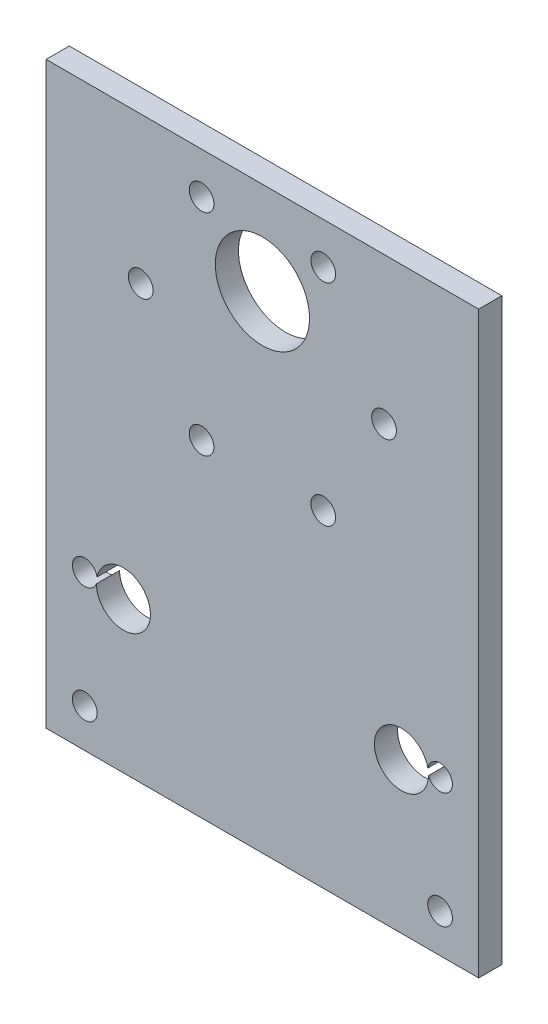
ISO-10303-21;
HEADER;
FILE_DESCRIPTION(('STEP AP214'),'2;1');
FILE_NAME('part.step','',(''),(''),'','','');
FILE_SCHEMA(('AUTOMOTIVE_DESIGN { 1 0 10303 214 1 1 1 1 }'));
ENDSEC;
DATA;
#1=APPLICATION_CONTEXT('core data for automotive mechanical design processes');
#2=APPLICATION_PROTOCOL_DEFINITION('international standard','automotive_design',2000,#1);
#3=PRODUCT_CONTEXT('',#1,'mechanical');
#4=PRODUCT('Part','Part','',(#3));
#5=PRODUCT_RELATED_PRODUCT_CATEGORY('part','',(#4));
#6=PRODUCT_DEFINITION_FORMATION('','',#4);
#7=PRODUCT_DEFINITION_CONTEXT('part definition',#1,'design');
#8=PRODUCT_DEFINITION('design','',#6,#7);
#9=PRODUCT_DEFINITION_SHAPE('','',#8);
#10=(LENGTH_UNIT() NAMED_UNIT(*) SI_UNIT(.MILLI.,.METRE.));
#11=(NAMED_UNIT(*) PLANE_ANGLE_UNIT() SI_UNIT($,.RADIAN.));
#12=(NAMED_UNIT(*) SI_UNIT($,.STERADIAN.) SOLID_ANGLE_UNIT());
#13=UNCERTAINTY_MEASURE_WITH_UNIT(LENGTH_MEASURE(1.E-05),#10,'distance_accuracy_value','');
#14=(GEOMETRIC_REPRESENTATION_CONTEXT(3) GLOBAL_UNCERTAINTY_ASSIGNED_CONTEXT((#13)) GLOBAL_UNIT_ASSIGNED_CONTEXT((#10,
#11,#12)) REPRESENTATION_CONTEXT('',''));
#15=CARTESIAN_POINT('',(0.,0.,0.));
#16=DIRECTION('',(0.,0.,1.));
#17=DIRECTION('',(1.,0.,0.));
#18=AXIS2_PLACEMENT_3D('',#15,#16,#17);
#19=CARTESIAN_POINT('',(28.,0.,3.));
#20=DIRECTION('',(1.,0.,0.));
#21=DIRECTION('',(0.,0.,-1.));
#22=AXIS2_PLACEMENT_3D('',#19,#20,#21);
#23=PLANE('',#22);
#24=DIRECTION('',(0.,-1.,0.));
#25=VECTOR('',#24,1.);
#26=CARTESIAN_POINT('',(28.,0.,0.));
#27=LINE('',#26,#25);
#28=CARTESIAN_POINT('',(28.,62.5,0.));
#29=VERTEX_POINT('',#28);
#30=CARTESIAN_POINT('',(28.,-12.5,0.));
#31=VERTEX_POINT('',#30);
#32=EDGE_CURVE('E186',#29,#31,#27,.T.);
#33=ORIENTED_EDGE('',*,*,#32,.F.);
#34=DIRECTION('',(0.,0.,-1.));
#35=VECTOR('',#34,1.);
#36=CARTESIAN_POINT('',(28.,62.5,3.));
#37=LINE('',#36,#35);
#38=CARTESIAN_POINT('',(28.,62.5,3.));
#39=VERTEX_POINT('',#38);
#40=EDGE_CURVE('E130',#39,#29,#37,.T.);
#41=ORIENTED_EDGE('',*,*,#40,.F.);
#42=DIRECTION('',(0.,-1.,0.));
#43=VECTOR('',#42,1.);
#44=CARTESIAN_POINT('',(28.,0.,3.));
#45=LINE('',#44,#43);
#46=CARTESIAN_POINT('',(28.,-12.5,3.));
#47=VERTEX_POINT('',#46);
#48=EDGE_CURVE('E121',#39,#47,#45,.T.);
#49=ORIENTED_EDGE('',*,*,#48,.T.);
#50=DIRECTION('',(0.,0.,-1.));
#51=VECTOR('',#50,1.);
#52=CARTESIAN_POINT('',(28.,-12.5,3.));
#53=LINE('',#52,#51);
#54=EDGE_CURVE('E55',#47,#31,#53,.T.);
#55=ORIENTED_EDGE('',*,*,#54,.T.);
#56=EDGE_LOOP('',(#33,#41,#49,#55));
#57=FACE_BOUND('',#56,.T.);
#58=ADVANCED_FACE('F47',(#57),#23,.T.);
#59=CARTESIAN_POINT('',(-28.,0.,3.));
#60=DIRECTION('',(1.,0.,0.));
#61=DIRECTION('',(0.,0.,-1.));
#62=AXIS2_PLACEMENT_3D('',#59,#60,#61);
#63=PLANE('',#62);
#64=DIRECTION('',(0.,-1.,0.));
#65=VECTOR('',#64,1.);
#66=CARTESIAN_POINT('',(-28.,0.,0.));
#67=LINE('',#66,#65);
#68=CARTESIAN_POINT('',(-28.,62.5,0.));
#69=VERTEX_POINT('',#68);
#70=CARTESIAN_POINT('',(-28.,-12.5,0.));
#71=VERTEX_POINT('',#70);
#72=EDGE_CURVE('E189',#69,#71,#67,.T.);
#73=ORIENTED_EDGE('',*,*,#72,.T.);
#74=DIRECTION('',(0.,0.,-1.));
#75=VECTOR('',#74,1.);
#76=CARTESIAN_POINT('',(-28.,-12.5,3.));
#77=LINE('',#76,#75);
#78=CARTESIAN_POINT('',(-28.,-12.5,3.));
#79=VERTEX_POINT('',#78);
#80=EDGE_CURVE('E12',#79,#71,#77,.T.);
#81=ORIENTED_EDGE('',*,*,#80,.F.);
#82=DIRECTION('',(0.,-1.,0.));
#83=VECTOR('',#82,1.);
#84=CARTESIAN_POINT('',(-28.,0.,3.));
#85=LINE('',#84,#83);
#86=CARTESIAN_POINT('',(-28.,62.5,3.));
#87=VERTEX_POINT('',#86);
#88=EDGE_CURVE('E113',#87,#79,#85,.T.);
#89=ORIENTED_EDGE('',*,*,#88,.F.);
#90=DIRECTION('',(0.,0.,1.));
#91=VECTOR('',#90,1.);
#92=CARTESIAN_POINT('',(-28.,62.5,3.));
#93=LINE('',#92,#91);
#94=EDGE_CURVE('E118',#69,#87,#93,.T.);
#95=ORIENTED_EDGE('',*,*,#94,.F.);
#96=EDGE_LOOP('',(#73,#81,#89,#95));
#97=FACE_BOUND('',#96,.T.);
#98=ADVANCED_FACE('F116',(#97),#63,.F.);
#99=CARTESIAN_POINT('',(-18.,7.,3.));
#100=DIRECTION('',(0.,0.,-1.));
#101=DIRECTION('',(-1.,0.,0.));
#102=AXIS2_PLACEMENT_3D('',#99,#100,#101);
#103=CYLINDRICAL_SURFACE('',#102,3.50000000000001);
#104=DIRECTION('',(0.,0.,1.));
#105=VECTOR('',#104,1.);
#106=CARTESIAN_POINT('',(-21.4192533056283,7.74746694371741,0.));
#107=LINE('',#106,#105);
#108=CARTESIAN_POINT('',(-21.4192533056283,7.74746694371741,0.));
#109=VERTEX_POINT('',#108);
#110=CARTESIAN_POINT('',(-21.4192533056283,7.74746694371741,3.));
#111=VERTEX_POINT('',#110);
#112=EDGE_CURVE('E167',#109,#111,#107,.T.);
#113=ORIENTED_EDGE('',*,*,#112,.F.);
#114=CARTESIAN_POINT('',(-18.,7.,0.));
#115=DIRECTION('',(0.,0.,1.));
#116=DIRECTION('',(1.,0.,0.));
#117=AXIS2_PLACEMENT_3D('',#114,#115,#116);
#118=CIRCLE('',#117,3.50000000000001);
#119=CARTESIAN_POINT('',(-21.4995585755599,6.9444142444014,0.));
#120=VERTEX_POINT('',#119);
#121=EDGE_CURVE('E183',#120,#109,#118,.T.);
#122=ORIENTED_EDGE('',*,*,#121,.F.);
#123=DIRECTION('',(0.,0.,1.));
#124=VECTOR('',#123,1.);
#125=CARTESIAN_POINT('',(-21.4995585755599,6.9444142444014,0.));
#126=LINE('',#125,#124);
#127=CARTESIAN_POINT('',(-21.4995585755599,6.9444142444014,3.));
#128=VERTEX_POINT('',#127);
#129=EDGE_CURVE('E62',#120,#128,#126,.T.);
#130=ORIENTED_EDGE('',*,*,#129,.T.);
#131=CARTESIAN_POINT('',(-18.,7.,3.));
#132=DIRECTION('',(0.,0.,1.));
#133=DIRECTION('',(1.,0.,0.));
#134=AXIS2_PLACEMENT_3D('',#131,#132,#133);
#135=CIRCLE('',#134,3.50000000000001);
#136=EDGE_CURVE('E175',#128,#111,#135,.T.);
#137=ORIENTED_EDGE('',*,*,#136,.T.);
#138=EDGE_LOOP('',(#113,#122,#130,#137));
#139=FACE_BOUND('',#138,.T.);
#140=ADVANCED_FACE('F218',(#139),#103,.F.);
#141=CARTESIAN_POINT('',(18.,7.,3.));
#142=DIRECTION('',(0.,0.,-1.));
#143=DIRECTION('',(-1.,0.,0.));
#144=AXIS2_PLACEMENT_3D('',#141,#142,#143);
#145=CYLINDRICAL_SURFACE('',#144,3.50000000000001);
#146=DIRECTION('',(0.,0.,1.));
#147=VECTOR('',#146,1.);
#148=CARTESIAN_POINT('',(21.4995585755599,6.9444142444014,0.));
#149=LINE('',#148,#147);
#150=CARTESIAN_POINT('',(21.4995585755599,6.9444142444014,0.));
#151=VERTEX_POINT('',#150);
#152=CARTESIAN_POINT('',(21.4995585755599,6.9444142444014,3.));
#153=VERTEX_POINT('',#152);
#154=EDGE_CURVE('E161',#151,#153,#149,.T.);
#155=ORIENTED_EDGE('',*,*,#154,.F.);
#156=CARTESIAN_POINT('',(18.,7.,0.));
#157=DIRECTION('',(0.,0.,1.));
#158=DIRECTION('',(1.,0.,0.));
#159=AXIS2_PLACEMENT_3D('',#156,#157,#158);
#160=CIRCLE('',#159,3.50000000000001);
#161=CARTESIAN_POINT('',(21.4192533056283,7.74746694371741,0.));
#162=VERTEX_POINT('',#161);
#163=EDGE_CURVE('E170',#162,#151,#160,.T.);
#164=ORIENTED_EDGE('',*,*,#163,.F.);
#165=DIRECTION('',(0.,0.,1.));
#166=VECTOR('',#165,1.);
#167=CARTESIAN_POINT('',(21.4192533056283,7.74746694371741,0.));
#168=LINE('',#167,#166);
#169=CARTESIAN_POINT('',(21.4192533056283,7.74746694371741,3.));
#170=VERTEX_POINT('',#169);
#171=EDGE_CURVE('E70',#162,#170,#168,.T.);
#172=ORIENTED_EDGE('',*,*,#171,.T.);
#173=CARTESIAN_POINT('',(18.,7.,3.));
#174=DIRECTION('',(0.,0.,1.));
#175=DIRECTION('',(1.,0.,0.));
#176=AXIS2_PLACEMENT_3D('',#173,#174,#175);
#177=CIRCLE('',#176,3.50000000000001);
#178=EDGE_CURVE('E172',#170,#153,#177,.T.);
#179=ORIENTED_EDGE('',*,*,#178,.T.);
#180=EDGE_LOOP('',(#155,#164,#172,#179));
#181=FACE_BOUND('',#180,.T.);
#182=ADVANCED_FACE('F49',(#181),#145,.F.);
#183=CARTESIAN_POINT('',(0.,-12.5,3.));
#184=DIRECTION('',(0.,1.,0.));
#185=DIRECTION('',(-1.,0.,0.));
#186=AXIS2_PLACEMENT_3D('',#183,#184,#185);
#187=PLANE('',#186);
#188=DIRECTION('',(1.,0.,0.));
#189=VECTOR('',#188,1.);
#190=CARTESIAN_POINT('',(0.,-12.5,0.));
#191=LINE('',#190,#189);
#192=EDGE_CURVE('E176',#71,#31,#191,.T.);
#193=ORIENTED_EDGE('',*,*,#192,.T.);
#194=ORIENTED_EDGE('',*,*,#54,.F.);
#195=DIRECTION('',(1.,0.,0.));
#196=VECTOR('',#195,1.);
#197=CARTESIAN_POINT('',(0.,-12.5,3.));
#198=LINE('',#197,#196);
#199=EDGE_CURVE('E120',#79,#47,#198,.T.);
#200=ORIENTED_EDGE('',*,*,#199,.F.);
#201=ORIENTED_EDGE('',*,*,#80,.T.);
#202=EDGE_LOOP('',(#193,#194,#200,#201));
#203=FACE_BOUND('',#202,.T.);
#204=ADVANCED_FACE('F195',(#203),#187,.F.);
#205=CARTESIAN_POINT('',(0.,0.,3.));
#206=DIRECTION('',(0.,0.,1.));
#207=DIRECTION('',(1.,0.,0.));
#208=AXIS2_PLACEMENT_3D('',#205,#206,#207);
#209=PLANE('',#208);
#210=CARTESIAN_POINT('',(7.87500000000003,29.8600998903951,3.));
#211=DIRECTION('',(0.,0.,1.));
#212=DIRECTION('',(1.,0.,0.));
#213=AXIS2_PLACEMENT_3D('',#210,#211,#212);
#214=CIRCLE('',#213,1.6);
#215=CARTESIAN_POINT('',(9.47500000000003,29.8600998903951,3.));
#216=VERTEX_POINT('',#215);
#217=EDGE_CURVE('E136',#216,#216,#214,.F.);
#218=ORIENTED_EDGE('',*,*,#217,.T.);
#219=EDGE_LOOP('',(#218));
#220=FACE_BOUND('',#219,.T.);
#221=CARTESIAN_POINT('',(-7.87500000000001,29.8600998903951,3.));
#222=DIRECTION('',(0.,0.,1.));
#223=DIRECTION('',(1.,0.,0.));
#224=AXIS2_PLACEMENT_3D('',#221,#222,#223);
#225=CIRCLE('',#224,1.6);
#226=CARTESIAN_POINT('',(-6.27500000000001,29.8600998903951,3.));
#227=VERTEX_POINT('',#226);
#228=EDGE_CURVE('E139',#227,#227,#225,.F.);
#229=ORIENTED_EDGE('',*,*,#228,.T.);
#230=EDGE_LOOP('',(#229));
#231=FACE_BOUND('',#230,.T.);
#232=CARTESIAN_POINT('',(0.,50.5,3.));
#233=DIRECTION('',(0.,0.,1.));
#234=DIRECTION('',(1.,0.,0.));
#235=AXIS2_PLACEMENT_3D('',#232,#233,#234);
#236=CIRCLE('',#235,6.1);
#237=CARTESIAN_POINT('',(6.1,50.5,3.));
#238=VERTEX_POINT('',#237);
#239=EDGE_CURVE('E321',#238,#238,#236,.F.);
#240=ORIENTED_EDGE('',*,*,#239,.T.);
#241=EDGE_LOOP('',(#240));
#242=FACE_BOUND('',#241,.T.);
#243=CARTESIAN_POINT('',(-7.87499999999992,57.139900109605,3.));
#244=DIRECTION('',(0.,0.,1.));
#245=DIRECTION('',(1.,0.,0.));
#246=AXIS2_PLACEMENT_3D('',#243,#244,#245);
#247=CIRCLE('',#246,1.6);
#248=CARTESIAN_POINT('',(-6.27499999999992,57.139900109605,3.));
#249=VERTEX_POINT('',#248);
#250=EDGE_CURVE('E318',#249,#249,#247,.F.);
#251=ORIENTED_EDGE('',*,*,#250,.T.);
#252=EDGE_LOOP('',(#251));
#253=FACE_BOUND('',#252,.T.);
#254=CARTESIAN_POINT('',(-15.75,43.5,3.));
#255=DIRECTION('',(0.,0.,1.));
#256=DIRECTION('',(1.,0.,0.));
#257=AXIS2_PLACEMENT_3D('',#254,#255,#256);
#258=CIRCLE('',#257,1.6);
#259=CARTESIAN_POINT('',(-14.15,43.5,3.));
#260=VERTEX_POINT('',#259);
#261=EDGE_CURVE('E287',#260,#260,#258,.F.);
#262=ORIENTED_EDGE('',*,*,#261,.T.);
#263=EDGE_LOOP('',(#262));
#264=FACE_BOUND('',#263,.T.);
#265=CARTESIAN_POINT('',(15.75,43.5,3.));
#266=DIRECTION('',(0.,0.,1.));
#267=DIRECTION('',(1.,0.,0.));
#268=AXIS2_PLACEMENT_3D('',#265,#266,#267);
#269=CIRCLE('',#268,1.6);
#270=CARTESIAN_POINT('',(17.35,43.5,3.));
#271=VERTEX_POINT('',#270);
#272=EDGE_CURVE('E314',#271,#271,#269,.F.);
#273=ORIENTED_EDGE('',*,*,#272,.T.);
#274=EDGE_LOOP('',(#273));
#275=FACE_BOUND('',#274,.T.);
#276=CARTESIAN_POINT('',(7.87499999999992,57.139900109605,3.));
#277=DIRECTION('',(0.,0.,1.));
#278=DIRECTION('',(1.,0.,0.));
#279=AXIS2_PLACEMENT_3D('',#276,#277,#278);
#280=CIRCLE('',#279,1.6);
#281=CARTESIAN_POINT('',(9.47499999999992,57.139900109605,3.));
#282=VERTEX_POINT('',#281);
#283=EDGE_CURVE('E311',#282,#282,#280,.F.);
#284=ORIENTED_EDGE('',*,*,#283,.T.);
#285=EDGE_LOOP('',(#284));
#286=FACE_BOUND('',#285,.T.);
#287=CARTESIAN_POINT('',(-23.,-7.5,3.));
#288=DIRECTION('',(0.,0.,1.));
#289=DIRECTION('',(1.,0.,0.));
#290=AXIS2_PLACEMENT_3D('',#287,#288,#289);
#291=CIRCLE('',#290,1.6);
#292=CARTESIAN_POINT('',(-21.4,-7.5,3.));
#293=VERTEX_POINT('',#292);
#294=EDGE_CURVE('E156',#293,#293,#291,.T.);
#295=ORIENTED_EDGE('',*,*,#294,.F.);
#296=EDGE_LOOP('',(#295));
#297=FACE_BOUND('',#296,.T.);
#298=CARTESIAN_POINT('',(23.,7.5,3.));
#299=DIRECTION('',(0.,0.,1.));
#300=DIRECTION('',(1.,0.,0.));
#301=AXIS2_PLACEMENT_3D('',#298,#299,#300);
#302=CIRCLE('',#301,1.6);
#303=EDGE_CURVE('E149',#153,#170,#302,.T.);
#304=ORIENTED_EDGE('',*,*,#303,.F.);
#305=ORIENTED_EDGE('',*,*,#178,.F.);
#306=EDGE_LOOP('',(#304,#305));
#307=FACE_BOUND('',#306,.T.);
#308=CARTESIAN_POINT('',(23.,-7.5,3.));
#309=DIRECTION('',(0.,0.,1.));
#310=DIRECTION('',(1.,0.,0.));
#311=AXIS2_PLACEMENT_3D('',#308,#309,#310);
#312=CIRCLE('',#311,1.6);
#313=CARTESIAN_POINT('',(24.6,-7.5,3.));
#314=VERTEX_POINT('',#313);
#315=EDGE_CURVE('E145',#314,#314,#312,.T.);
#316=ORIENTED_EDGE('',*,*,#315,.F.);
#317=EDGE_LOOP('',(#316));
#318=FACE_BOUND('',#317,.T.);
#319=CARTESIAN_POINT('',(-23.,7.5,3.));
#320=DIRECTION('',(0.,0.,1.));
#321=DIRECTION('',(1.,0.,0.));
#322=AXIS2_PLACEMENT_3D('',#319,#320,#321);
#323=CIRCLE('',#322,1.6);
#324=EDGE_CURVE('E155',#111,#128,#323,.T.);
#325=ORIENTED_EDGE('',*,*,#324,.F.);
#326=ORIENTED_EDGE('',*,*,#136,.F.);
#327=EDGE_LOOP('',(#325,#326));
#328=FACE_BOUND('',#327,.T.);
#329=ORIENTED_EDGE('',*,*,#48,.F.);
#330=DIRECTION('',(1.,0.,0.));
#331=VECTOR('',#330,1.);
#332=CARTESIAN_POINT('',(-28.,62.5,3.));
#333=LINE('',#332,#331);
#334=EDGE_CURVE('E124',#87,#39,#333,.T.);
#335=ORIENTED_EDGE('',*,*,#334,.F.);
#336=ORIENTED_EDGE('',*,*,#88,.T.);
#337=ORIENTED_EDGE('',*,*,#199,.T.);
#338=EDGE_LOOP('',(#329,#335,#336,#337));
#339=FACE_BOUND('',#338,.T.);
#340=ADVANCED_FACE('F125',(#220,#231,#242,#253,#264,#275,#286,#297,#307,#318,#328,#339),#209,.T.);
#341=CARTESIAN_POINT('',(0.,0.,0.));
#342=DIRECTION('',(0.,0.,1.));
#343=DIRECTION('',(1.,0.,0.));
#344=AXIS2_PLACEMENT_3D('',#341,#342,#343);
#345=PLANE('',#344);
#346=CARTESIAN_POINT('',(7.87500000000003,29.8600998903951,0.));
#347=DIRECTION('',(0.,0.,1.));
#348=DIRECTION('',(1.,0.,0.));
#349=AXIS2_PLACEMENT_3D('',#346,#347,#348);
#350=CIRCLE('',#349,1.6);
#351=CARTESIAN_POINT('',(9.47500000000003,29.8600998903951,0.));
#352=VERTEX_POINT('',#351);
#353=EDGE_CURVE('E307',#352,#352,#350,.T.);
#354=ORIENTED_EDGE('',*,*,#353,.T.);
#355=EDGE_LOOP('',(#354));
#356=FACE_BOUND('',#355,.T.);
#357=CARTESIAN_POINT('',(-7.87500000000001,29.8600998903951,0.));
#358=DIRECTION('',(0.,0.,1.));
#359=DIRECTION('',(1.,0.,0.));
#360=AXIS2_PLACEMENT_3D('',#357,#358,#359);
#361=CIRCLE('',#360,1.6);
#362=CARTESIAN_POINT('',(-6.27500000000001,29.8600998903951,0.));
#363=VERTEX_POINT('',#362);
#364=EDGE_CURVE('E299',#363,#363,#361,.T.);
#365=ORIENTED_EDGE('',*,*,#364,.T.);
#366=EDGE_LOOP('',(#365));
#367=FACE_BOUND('',#366,.T.);
#368=CARTESIAN_POINT('',(0.,50.5,0.));
#369=DIRECTION('',(0.,0.,1.));
#370=DIRECTION('',(1.,0.,0.));
#371=AXIS2_PLACEMENT_3D('',#368,#369,#370);
#372=CIRCLE('',#371,6.1);
#373=CARTESIAN_POINT('',(6.1,50.5,0.));
#374=VERTEX_POINT('',#373);
#375=EDGE_CURVE('E296',#374,#374,#372,.T.);
#376=ORIENTED_EDGE('',*,*,#375,.T.);
#377=EDGE_LOOP('',(#376));
#378=FACE_BOUND('',#377,.T.);
#379=CARTESIAN_POINT('',(-7.87499999999992,57.139900109605,0.));
#380=DIRECTION('',(0.,0.,1.));
#381=DIRECTION('',(1.,0.,0.));
#382=AXIS2_PLACEMENT_3D('',#379,#380,#381);
#383=CIRCLE('',#382,1.6);
#384=CARTESIAN_POINT('',(-6.27499999999992,57.139900109605,0.));
#385=VERTEX_POINT('',#384);
#386=EDGE_CURVE('E292',#385,#385,#383,.T.);
#387=ORIENTED_EDGE('',*,*,#386,.T.);
#388=EDGE_LOOP('',(#387));
#389=FACE_BOUND('',#388,.T.);
#390=CARTESIAN_POINT('',(-15.75,43.5,0.));
#391=DIRECTION('',(0.,0.,1.));
#392=DIRECTION('',(1.,0.,0.));
#393=AXIS2_PLACEMENT_3D('',#390,#391,#392);
#394=CIRCLE('',#393,1.6);
#395=CARTESIAN_POINT('',(-14.15,43.5,0.));
#396=VERTEX_POINT('',#395);
#397=EDGE_CURVE('E290',#396,#396,#394,.T.);
#398=ORIENTED_EDGE('',*,*,#397,.T.);
#399=EDGE_LOOP('',(#398));
#400=FACE_BOUND('',#399,.T.);
#401=CARTESIAN_POINT('',(15.75,43.5,0.));
#402=DIRECTION('',(0.,0.,1.));
#403=DIRECTION('',(1.,0.,0.));
#404=AXIS2_PLACEMENT_3D('',#401,#402,#403);
#405=CIRCLE('',#404,1.6);
#406=CARTESIAN_POINT('',(17.35,43.5,0.));
#407=VERTEX_POINT('',#406);
#408=EDGE_CURVE('E293',#407,#407,#405,.T.);
#409=ORIENTED_EDGE('',*,*,#408,.T.);
#410=EDGE_LOOP('',(#409));
#411=FACE_BOUND('',#410,.T.);
#412=CARTESIAN_POINT('',(7.87499999999992,57.139900109605,0.));
#413=DIRECTION('',(0.,0.,1.));
#414=DIRECTION('',(1.,0.,0.));
#415=AXIS2_PLACEMENT_3D('',#412,#413,#414);
#416=CIRCLE('',#415,1.6);
#417=CARTESIAN_POINT('',(9.47499999999992,57.139900109605,0.));
#418=VERTEX_POINT('',#417);
#419=EDGE_CURVE('E303',#418,#418,#416,.T.);
#420=ORIENTED_EDGE('',*,*,#419,.T.);
#421=EDGE_LOOP('',(#420));
#422=FACE_BOUND('',#421,.T.);
#423=CARTESIAN_POINT('',(-23.,-7.5,0.));
#424=DIRECTION('',(0.,0.,1.));
#425=DIRECTION('',(1.,0.,0.));
#426=AXIS2_PLACEMENT_3D('',#423,#424,#425);
#427=CIRCLE('',#426,1.6);
#428=CARTESIAN_POINT('',(-21.4,-7.5,0.));
#429=VERTEX_POINT('',#428);
#430=EDGE_CURVE('E152',#429,#429,#427,.T.);
#431=ORIENTED_EDGE('',*,*,#430,.T.);
#432=EDGE_LOOP('',(#431));
#433=FACE_BOUND('',#432,.T.);
#434=CARTESIAN_POINT('',(23.,-7.5,0.));
#435=DIRECTION('',(0.,0.,1.));
#436=DIRECTION('',(1.,0.,0.));
#437=AXIS2_PLACEMENT_3D('',#434,#435,#436);
#438=CIRCLE('',#437,1.6);
#439=CARTESIAN_POINT('',(24.6,-7.5,0.));
#440=VERTEX_POINT('',#439);
#441=EDGE_CURVE('E146',#440,#440,#438,.T.);
#442=ORIENTED_EDGE('',*,*,#441,.T.);
#443=EDGE_LOOP('',(#442));
#444=FACE_BOUND('',#443,.T.);
#445=ORIENTED_EDGE('',*,*,#163,.T.);
#446=CARTESIAN_POINT('',(23.,7.5,0.));
#447=DIRECTION('',(0.,0.,1.));
#448=DIRECTION('',(1.,0.,0.));
#449=AXIS2_PLACEMENT_3D('',#446,#447,#448);
#450=CIRCLE('',#449,1.6);
#451=EDGE_CURVE('E159',#151,#162,#450,.T.);
#452=ORIENTED_EDGE('',*,*,#451,.T.);
#453=EDGE_LOOP('',(#445,#452));
#454=FACE_BOUND('',#453,.T.);
#455=ORIENTED_EDGE('',*,*,#121,.T.);
#456=CARTESIAN_POINT('',(-23.,7.5,0.));
#457=DIRECTION('',(0.,0.,1.));
#458=DIRECTION('',(1.,0.,0.));
#459=AXIS2_PLACEMENT_3D('',#456,#457,#458);
#460=CIRCLE('',#459,1.6);
#461=EDGE_CURVE('E165',#109,#120,#460,.T.);
#462=ORIENTED_EDGE('',*,*,#461,.T.);
#463=EDGE_LOOP('',(#455,#462));
#464=FACE_BOUND('',#463,.T.);
#465=ORIENTED_EDGE('',*,*,#32,.T.);
#466=ORIENTED_EDGE('',*,*,#192,.F.);
#467=ORIENTED_EDGE('',*,*,#72,.F.);
#468=DIRECTION('',(-1.,0.,0.));
#469=VECTOR('',#468,1.);
#470=CARTESIAN_POINT('',(-28.,62.5,0.));
#471=LINE('',#470,#469);
#472=EDGE_CURVE('E135',#29,#69,#471,.T.);
#473=ORIENTED_EDGE('',*,*,#472,.F.);
#474=EDGE_LOOP('',(#465,#466,#467,#473));
#475=FACE_BOUND('',#474,.T.);
#476=ADVANCED_FACE('F197',(#356,#367,#378,#389,#400,#411,#422,#433,#444,#454,#464,#475),#345,.F.);
#477=CARTESIAN_POINT('',(-23.,7.5,0.));
#478=DIRECTION('',(0.,0.,1.));
#479=DIRECTION('',(1.,0.,0.));
#480=AXIS2_PLACEMENT_3D('',#477,#478,#479);
#481=CYLINDRICAL_SURFACE('',#480,1.6);
#482=ORIENTED_EDGE('',*,*,#324,.T.);
#483=ORIENTED_EDGE('',*,*,#129,.F.);
#484=ORIENTED_EDGE('',*,*,#461,.F.);
#485=ORIENTED_EDGE('',*,*,#112,.T.);
#486=EDGE_LOOP('',(#482,#483,#484,#485));
#487=FACE_BOUND('',#486,.T.);
#488=ADVANCED_FACE('F199',(#487),#481,.F.);
#489=CARTESIAN_POINT('',(23.,-7.5,0.));
#490=DIRECTION('',(0.,0.,1.));
#491=DIRECTION('',(1.,0.,0.));
#492=AXIS2_PLACEMENT_3D('',#489,#490,#491);
#493=CYLINDRICAL_SURFACE('',#492,1.6);
#494=ORIENTED_EDGE('',*,*,#441,.F.);
#495=EDGE_LOOP('',(#494));
#496=FACE_BOUND('',#495,.T.);
#497=ORIENTED_EDGE('',*,*,#315,.T.);
#498=EDGE_LOOP('',(#497));
#499=FACE_BOUND('',#498,.T.);
#500=ADVANCED_FACE('F206',(#496,#499),#493,.F.);
#501=CARTESIAN_POINT('',(23.,7.5,0.));
#502=DIRECTION('',(0.,0.,1.));
#503=DIRECTION('',(1.,0.,0.));
#504=AXIS2_PLACEMENT_3D('',#501,#502,#503);
#505=CYLINDRICAL_SURFACE('',#504,1.6);
#506=ORIENTED_EDGE('',*,*,#303,.T.);
#507=ORIENTED_EDGE('',*,*,#171,.F.);
#508=ORIENTED_EDGE('',*,*,#451,.F.);
#509=ORIENTED_EDGE('',*,*,#154,.T.);
#510=EDGE_LOOP('',(#506,#507,#508,#509));
#511=FACE_BOUND('',#510,.T.);
#512=ADVANCED_FACE('F240',(#511),#505,.F.);
#513=CARTESIAN_POINT('',(-23.,-7.5,0.));
#514=DIRECTION('',(0.,0.,1.));
#515=DIRECTION('',(1.,0.,0.));
#516=AXIS2_PLACEMENT_3D('',#513,#514,#515);
#517=CYLINDRICAL_SURFACE('',#516,1.6);
#518=ORIENTED_EDGE('',*,*,#430,.F.);
#519=EDGE_LOOP('',(#518));
#520=FACE_BOUND('',#519,.T.);
#521=ORIENTED_EDGE('',*,*,#294,.T.);
#522=EDGE_LOOP('',(#521));
#523=FACE_BOUND('',#522,.T.);
#524=ADVANCED_FACE('F242',(#520,#523),#517,.F.);
#525=CARTESIAN_POINT('',(0.,62.5,0.));
#526=DIRECTION('',(0.,-1.,0.));
#527=DIRECTION('',(0.,0.,-1.));
#528=AXIS2_PLACEMENT_3D('',#525,#526,#527);
#529=PLANE('',#528);
#530=ORIENTED_EDGE('',*,*,#94,.T.);
#531=ORIENTED_EDGE('',*,*,#334,.T.);
#532=ORIENTED_EDGE('',*,*,#40,.T.);
#533=ORIENTED_EDGE('',*,*,#472,.T.);
#534=EDGE_LOOP('',(#530,#531,#532,#533));
#535=FACE_BOUND('',#534,.T.);
#536=ADVANCED_FACE('F133',(#535),#529,.F.);
#537=CARTESIAN_POINT('',(7.87499999999992,57.139900109605,40.));
#538=DIRECTION('',(0.,0.,-1.));
#539=DIRECTION('',(-1.,0.,0.));
#540=AXIS2_PLACEMENT_3D('',#537,#538,#539);
#541=CYLINDRICAL_SURFACE('',#540,1.6);
#542=ORIENTED_EDGE('',*,*,#283,.F.);
#543=EDGE_LOOP('',(#542));
#544=FACE_BOUND('',#543,.T.);
#545=ORIENTED_EDGE('',*,*,#419,.F.);
#546=EDGE_LOOP('',(#545));
#547=FACE_BOUND('',#546,.T.);
#548=ADVANCED_FACE('F255',(#544,#547),#541,.F.);
#549=CARTESIAN_POINT('',(15.75,43.5,40.));
#550=DIRECTION('',(0.,0.,-1.));
#551=DIRECTION('',(-1.,0.,0.));
#552=AXIS2_PLACEMENT_3D('',#549,#550,#551);
#553=CYLINDRICAL_SURFACE('',#552,1.6);
#554=ORIENTED_EDGE('',*,*,#272,.F.);
#555=EDGE_LOOP('',(#554));
#556=FACE_BOUND('',#555,.T.);
#557=ORIENTED_EDGE('',*,*,#408,.F.);
#558=EDGE_LOOP('',(#557));
#559=FACE_BOUND('',#558,.T.);
#560=ADVANCED_FACE('F258',(#556,#559),#553,.F.);
#561=CARTESIAN_POINT('',(-15.75,43.5,40.));
#562=DIRECTION('',(0.,0.,-1.));
#563=DIRECTION('',(-1.,0.,0.));
#564=AXIS2_PLACEMENT_3D('',#561,#562,#563);
#565=CYLINDRICAL_SURFACE('',#564,1.6);
#566=ORIENTED_EDGE('',*,*,#261,.F.);
#567=EDGE_LOOP('',(#566));
#568=FACE_BOUND('',#567,.T.);
#569=ORIENTED_EDGE('',*,*,#397,.F.);
#570=EDGE_LOOP('',(#569));
#571=FACE_BOUND('',#570,.T.);
#572=ADVANCED_FACE('F272',(#568,#571),#565,.F.);
#573=CARTESIAN_POINT('',(-7.87499999999992,57.139900109605,40.));
#574=DIRECTION('',(0.,0.,-1.));
#575=DIRECTION('',(-1.,0.,0.));
#576=AXIS2_PLACEMENT_3D('',#573,#574,#575);
#577=CYLINDRICAL_SURFACE('',#576,1.6);
#578=ORIENTED_EDGE('',*,*,#250,.F.);
#579=EDGE_LOOP('',(#578));
#580=FACE_BOUND('',#579,.T.);
#581=ORIENTED_EDGE('',*,*,#386,.F.);
#582=EDGE_LOOP('',(#581));
#583=FACE_BOUND('',#582,.T.);
#584=ADVANCED_FACE('F269',(#580,#583),#577,.F.);
#585=CARTESIAN_POINT('',(0.,50.5,40.));
#586=DIRECTION('',(0.,0.,-1.));
#587=DIRECTION('',(-1.,0.,0.));
#588=AXIS2_PLACEMENT_3D('',#585,#586,#587);
#589=CYLINDRICAL_SURFACE('',#588,6.1);
#590=ORIENTED_EDGE('',*,*,#239,.F.);
#591=EDGE_LOOP('',(#590));
#592=FACE_BOUND('',#591,.T.);
#593=ORIENTED_EDGE('',*,*,#375,.F.);
#594=EDGE_LOOP('',(#593));
#595=FACE_BOUND('',#594,.T.);
#596=ADVANCED_FACE('F267',(#592,#595),#589,.F.);
#597=CARTESIAN_POINT('',(-7.87500000000001,29.8600998903951,40.));
#598=DIRECTION('',(0.,0.,-1.));
#599=DIRECTION('',(-1.,0.,0.));
#600=AXIS2_PLACEMENT_3D('',#597,#598,#599);
#601=CYLINDRICAL_SURFACE('',#600,1.6);
#602=ORIENTED_EDGE('',*,*,#228,.F.);
#603=EDGE_LOOP('',(#602));
#604=FACE_BOUND('',#603,.T.);
#605=ORIENTED_EDGE('',*,*,#364,.F.);
#606=EDGE_LOOP('',(#605));
#607=FACE_BOUND('',#606,.T.);
#608=ADVANCED_FACE('F263',(#604,#607),#601,.F.);
#609=CARTESIAN_POINT('',(7.87500000000003,29.8600998903951,40.));
#610=DIRECTION('',(0.,0.,-1.));
#611=DIRECTION('',(-1.,0.,0.));
#612=AXIS2_PLACEMENT_3D('',#609,#610,#611);
#613=CYLINDRICAL_SURFACE('',#612,1.6);
#614=ORIENTED_EDGE('',*,*,#217,.F.);
#615=EDGE_LOOP('',(#614));
#616=FACE_BOUND('',#615,.T.);
#617=ORIENTED_EDGE('',*,*,#353,.F.);
#618=EDGE_LOOP('',(#617));
#619=FACE_BOUND('',#618,.T.);
#620=ADVANCED_FACE('F260',(#616,#619),#613,.F.);
#621=CLOSED_SHELL('',(#58,#98,#140,#182,#204,#340,#476,#488,#500,#512,#524,#536,#548,#560,#572,
#584,#596,#608,#620));
#622=MANIFOLD_SOLID_BREP('B2',#621);
#623=ADVANCED_BREP_SHAPE_REPRESENTATION('',(#18,#622),#14);
#624=SHAPE_DEFINITION_REPRESENTATION(#9,#623);
ENDSEC;
END-ISO-10303-21;
